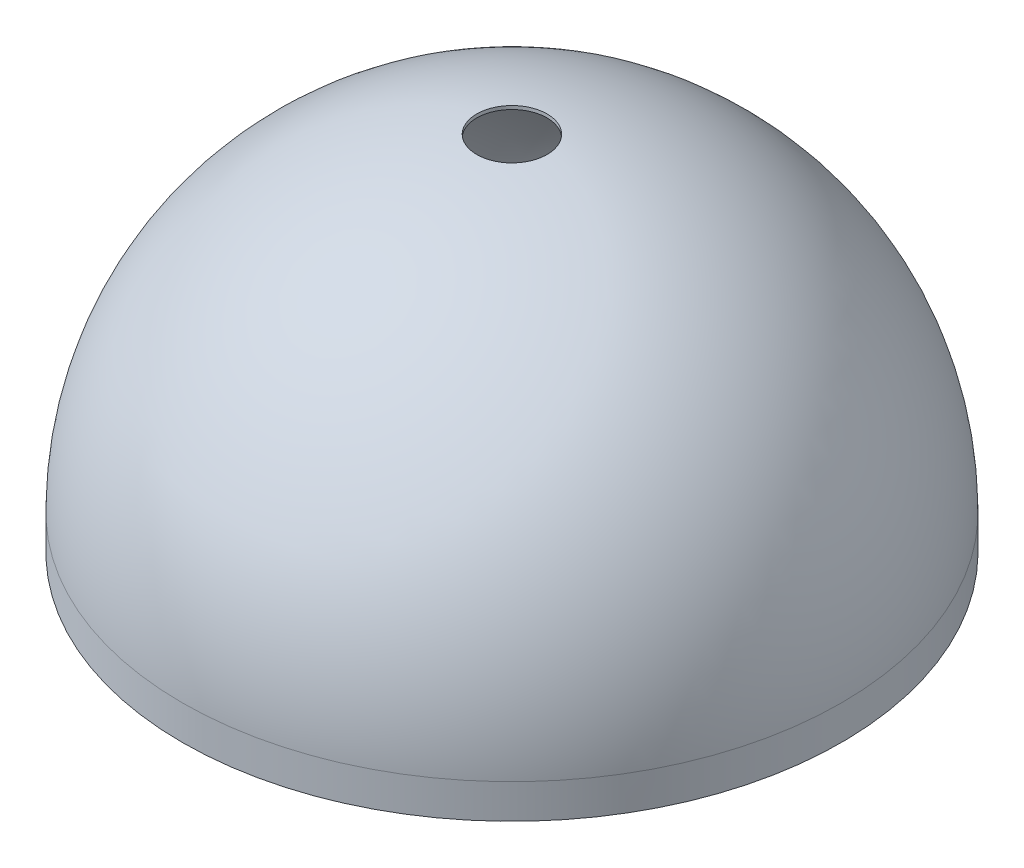
ISO-10303-21;
HEADER;
FILE_DESCRIPTION(('STEP AP214'),'2;1');
FILE_NAME('part.step','',(''),(''),'','','');
FILE_SCHEMA(('AUTOMOTIVE_DESIGN { 1 0 10303 214 1 1 1 1 }'));
ENDSEC;
DATA;
#1=APPLICATION_CONTEXT('core data for automotive mechanical design processes');
#2=APPLICATION_PROTOCOL_DEFINITION('international standard','automotive_design',2000,#1);
#3=PRODUCT_CONTEXT('',#1,'mechanical');
#4=PRODUCT('Part','Part','',(#3));
#5=PRODUCT_RELATED_PRODUCT_CATEGORY('part','',(#4));
#6=PRODUCT_DEFINITION_FORMATION('','',#4);
#7=PRODUCT_DEFINITION_CONTEXT('part definition',#1,'design');
#8=PRODUCT_DEFINITION('design','',#6,#7);
#9=PRODUCT_DEFINITION_SHAPE('','',#8);
#10=(LENGTH_UNIT() NAMED_UNIT(*) SI_UNIT(.MILLI.,.METRE.));
#11=(NAMED_UNIT(*) PLANE_ANGLE_UNIT() SI_UNIT($,.RADIAN.));
#12=(NAMED_UNIT(*) SI_UNIT($,.STERADIAN.) SOLID_ANGLE_UNIT());
#13=UNCERTAINTY_MEASURE_WITH_UNIT(LENGTH_MEASURE(1.E-05),#10,'distance_accuracy_value','');
#14=(GEOMETRIC_REPRESENTATION_CONTEXT(3) GLOBAL_UNCERTAINTY_ASSIGNED_CONTEXT((#13)) GLOBAL_UNIT_ASSIGNED_CONTEXT((#10,
#11,#12)) REPRESENTATION_CONTEXT('',''));
#15=CARTESIAN_POINT('',(0.,0.,0.));
#16=DIRECTION('',(0.,0.,1.));
#17=DIRECTION('',(1.,0.,0.));
#18=AXIS2_PLACEMENT_3D('',#15,#16,#17);
#19=CARTESIAN_POINT('',(0.,0.,0.));
#20=DIRECTION('',(0.,-1.,0.));
#21=DIRECTION('',(0.,0.,-1.));
#22=AXIS2_PLACEMENT_3D('',#19,#20,#21);
#23=SPHERICAL_SURFACE('',#22,24.384);
#24=CARTESIAN_POINT('',(0.,0.,0.));
#25=DIRECTION('',(0.,-1.,0.));
#26=DIRECTION('',(0.,0.,-1.));
#27=AXIS2_PLACEMENT_3D('',#24,#25,#26);
#28=CIRCLE('',#27,24.384);
#29=CARTESIAN_POINT('',(0.,0.,-24.384));
#30=VERTEX_POINT('',#29);
#31=EDGE_CURVE('E10',#30,#30,#28,.T.);
#32=ORIENTED_EDGE('',*,*,#31,.F.);
#33=EDGE_LOOP('',(#32));
#34=FACE_BOUND('',#33,.T.);
#35=CARTESIAN_POINT('',(0.,24.2446126747779,0.));
#36=DIRECTION('',(0.,-1.,0.));
#37=DIRECTION('',(0.,0.,-1.));
#38=AXIS2_PLACEMENT_3D('',#35,#36,#37);
#39=CIRCLE('',#38,2.6035);
#40=CARTESIAN_POINT('',(0.,24.2446126747779,-2.6035));
#41=VERTEX_POINT('',#40);
#42=EDGE_CURVE('E47',#41,#41,#39,.T.);
#43=ORIENTED_EDGE('',*,*,#42,.T.);
#44=EDGE_LOOP('',(#43));
#45=FACE_BOUND('',#44,.T.);
#46=ADVANCED_FACE('F39',(#34,#45),#23,.T.);
#47=CARTESIAN_POINT('',(0.,0.,0.));
#48=DIRECTION('',(0.,-1.,0.));
#49=DIRECTION('',(0.,0.,-1.));
#50=AXIS2_PLACEMENT_3D('',#47,#48,#49);
#51=SPHERICAL_SURFACE('',#50,24.13);
#52=CARTESIAN_POINT('',(0.,0.,0.));
#53=DIRECTION('',(0.,1.,0.));
#54=DIRECTION('',(0.,0.,1.));
#55=AXIS2_PLACEMENT_3D('',#52,#53,#54);
#56=CIRCLE('',#55,24.13);
#57=CARTESIAN_POINT('',(0.,0.,24.13));
#58=VERTEX_POINT('',#57);
#59=EDGE_CURVE('E59',#58,#58,#56,.T.);
#60=ORIENTED_EDGE('',*,*,#59,.F.);
#61=EDGE_LOOP('',(#60));
#62=FACE_BOUND('',#61,.T.);
#63=CARTESIAN_POINT('',(0.,23.9891368696333,0.));
#64=DIRECTION('',(0.,-1.,0.));
#65=DIRECTION('',(0.,0.,-1.));
#66=AXIS2_PLACEMENT_3D('',#63,#64,#65);
#67=CIRCLE('',#66,2.6035);
#68=CARTESIAN_POINT('',(0.,23.9891368696333,-2.6035));
#69=VERTEX_POINT('',#68);
#70=EDGE_CURVE('E42',#69,#69,#67,.T.);
#71=ORIENTED_EDGE('',*,*,#70,.F.);
#72=EDGE_LOOP('',(#71));
#73=FACE_BOUND('',#72,.T.);
#74=ADVANCED_FACE('F76',(#62,#73),#51,.F.);
#75=CARTESIAN_POINT('',(0.,24.384,0.));
#76=DIRECTION('',(0.,-1.,0.));
#77=DIRECTION('',(0.,0.,-1.));
#78=AXIS2_PLACEMENT_3D('',#75,#76,#77);
#79=CYLINDRICAL_SURFACE('',#78,2.6035);
#80=ORIENTED_EDGE('',*,*,#42,.F.);
#81=EDGE_LOOP('',(#80));
#82=FACE_BOUND('',#81,.T.);
#83=ORIENTED_EDGE('',*,*,#70,.T.);
#84=EDGE_LOOP('',(#83));
#85=FACE_BOUND('',#84,.T.);
#86=ADVANCED_FACE('F79',(#82,#85),#79,.F.);
#87=CARTESIAN_POINT('',(0.,-2.54,0.));
#88=DIRECTION('',(0.,1.,0.));
#89=DIRECTION('',(0.,0.,1.));
#90=AXIS2_PLACEMENT_3D('',#87,#88,#89);
#91=CYLINDRICAL_SURFACE('',#90,24.384);
#92=CARTESIAN_POINT('',(0.,-2.54,0.));
#93=DIRECTION('',(0.,1.,0.));
#94=DIRECTION('',(0.,0.,1.));
#95=AXIS2_PLACEMENT_3D('',#92,#93,#94);
#96=CIRCLE('',#95,24.384);
#97=CARTESIAN_POINT('',(0.,-2.54,24.384));
#98=VERTEX_POINT('',#97);
#99=EDGE_CURVE('E54',#98,#98,#96,.T.);
#100=ORIENTED_EDGE('',*,*,#99,.T.);
#101=EDGE_LOOP('',(#100));
#102=FACE_BOUND('',#101,.T.);
#103=ORIENTED_EDGE('',*,*,#31,.T.);
#104=EDGE_LOOP('',(#103));
#105=FACE_BOUND('',#104,.T.);
#106=ADVANCED_FACE('F85',(#102,#105),#91,.T.);
#107=CARTESIAN_POINT('',(0.,-2.54,0.));
#108=DIRECTION('',(0.,1.,0.));
#109=DIRECTION('',(0.,0.,1.));
#110=AXIS2_PLACEMENT_3D('',#107,#108,#109);
#111=PLANE('',#110);
#112=CARTESIAN_POINT('',(0.,-2.54,0.));
#113=DIRECTION('',(0.,1.,0.));
#114=DIRECTION('',(0.,0.,1.));
#115=AXIS2_PLACEMENT_3D('',#112,#113,#114);
#116=CIRCLE('',#115,24.13);
#117=CARTESIAN_POINT('',(0.,-2.54,24.13));
#118=VERTEX_POINT('',#117);
#119=EDGE_CURVE('E58',#118,#118,#116,.T.);
#120=ORIENTED_EDGE('',*,*,#119,.T.);
#121=EDGE_LOOP('',(#120));
#122=FACE_BOUND('',#121,.T.);
#123=ORIENTED_EDGE('',*,*,#99,.F.);
#124=EDGE_LOOP('',(#123));
#125=FACE_BOUND('',#124,.T.);
#126=ADVANCED_FACE('F67',(#122,#125),#111,.F.);
#127=CARTESIAN_POINT('',(0.,-2.54,0.));
#128=DIRECTION('',(0.,1.,0.));
#129=DIRECTION('',(0.,0.,1.));
#130=AXIS2_PLACEMENT_3D('',#127,#128,#129);
#131=CYLINDRICAL_SURFACE('',#130,24.13);
#132=ORIENTED_EDGE('',*,*,#119,.F.);
#133=EDGE_LOOP('',(#132));
#134=FACE_BOUND('',#133,.T.);
#135=ORIENTED_EDGE('',*,*,#59,.T.);
#136=EDGE_LOOP('',(#135));
#137=FACE_BOUND('',#136,.T.);
#138=ADVANCED_FACE('F70',(#134,#137),#131,.F.);
#139=CLOSED_SHELL('',(#46,#74,#86,#106,#126,#138));
#140=MANIFOLD_SOLID_BREP('B2',#139);
#141=ADVANCED_BREP_SHAPE_REPRESENTATION('',(#18,#140),#14);
#142=SHAPE_DEFINITION_REPRESENTATION(#9,#141);
ENDSEC;
END-ISO-10303-21;
